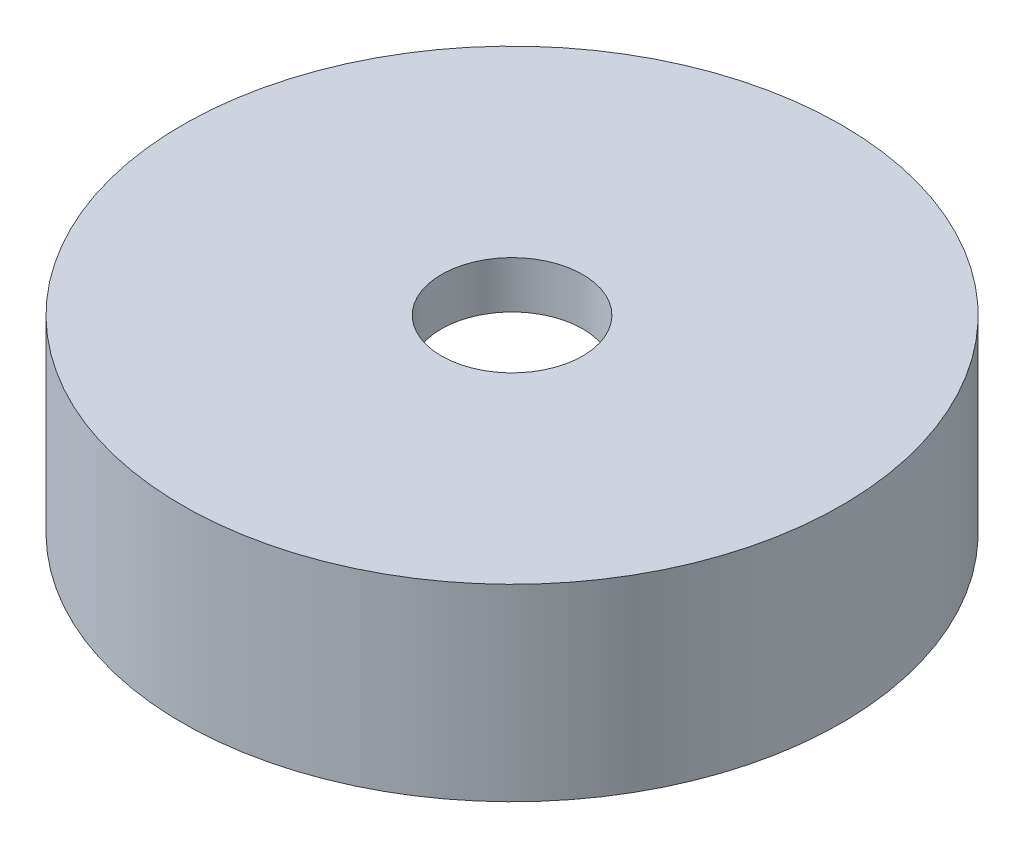
ISO-10303-21;
HEADER;
FILE_DESCRIPTION(('STEP AP214'),'2;1');
FILE_NAME('part.step','',(''),(''),'','','');
FILE_SCHEMA(('AUTOMOTIVE_DESIGN { 1 0 10303 214 1 1 1 1 }'));
ENDSEC;
DATA;
#1=APPLICATION_CONTEXT('core data for automotive mechanical design processes');
#2=APPLICATION_PROTOCOL_DEFINITION('international standard','automotive_design',2000,#1);
#3=PRODUCT_CONTEXT('',#1,'mechanical');
#4=PRODUCT('Part','Part','',(#3));
#5=PRODUCT_RELATED_PRODUCT_CATEGORY('part','',(#4));
#6=PRODUCT_DEFINITION_FORMATION('','',#4);
#7=PRODUCT_DEFINITION_CONTEXT('part definition',#1,'design');
#8=PRODUCT_DEFINITION('design','',#6,#7);
#9=PRODUCT_DEFINITION_SHAPE('','',#8);
#10=(LENGTH_UNIT() NAMED_UNIT(*) SI_UNIT(.MILLI.,.METRE.));
#11=(NAMED_UNIT(*) PLANE_ANGLE_UNIT() SI_UNIT($,.RADIAN.));
#12=(NAMED_UNIT(*) SI_UNIT($,.STERADIAN.) SOLID_ANGLE_UNIT());
#13=UNCERTAINTY_MEASURE_WITH_UNIT(LENGTH_MEASURE(1.E-05),#10,'distance_accuracy_value','');
#14=(GEOMETRIC_REPRESENTATION_CONTEXT(3) GLOBAL_UNCERTAINTY_ASSIGNED_CONTEXT((#13)) GLOBAL_UNIT_ASSIGNED_CONTEXT((#10,
#11,#12)) REPRESENTATION_CONTEXT('',''));
#15=CARTESIAN_POINT('',(0.,0.,0.));
#16=DIRECTION('',(0.,0.,1.));
#17=DIRECTION('',(1.,0.,0.));
#18=AXIS2_PLACEMENT_3D('',#15,#16,#17);
#19=CARTESIAN_POINT('',(0.,3.,0.));
#20=DIRECTION('',(0.,-1.,0.));
#21=DIRECTION('',(0.,0.,-1.));
#22=AXIS2_PLACEMENT_3D('',#19,#20,#21);
#23=PLANE('',#22);
#24=CARTESIAN_POINT('',(0.,3.,0.));
#25=DIRECTION('',(0.,-1.,0.));
#26=DIRECTION('',(0.,0.,-1.));
#27=AXIS2_PLACEMENT_3D('',#24,#25,#26);
#28=CIRCLE('',#27,1.49999999999999);
#29=CARTESIAN_POINT('',(0.,3.,-1.49999999999999));
#30=VERTEX_POINT('',#29);
#31=EDGE_CURVE('E60',#30,#30,#28,.T.);
#32=ORIENTED_EDGE('',*,*,#31,.F.);
#33=EDGE_LOOP('',(#32));
#34=FACE_BOUND('',#33,.T.);
#35=CARTESIAN_POINT('',(0.,3.,0.));
#36=DIRECTION('',(0.,-1.,0.));
#37=DIRECTION('',(0.,0.,-1.));
#38=AXIS2_PLACEMENT_3D('',#35,#36,#37);
#39=CIRCLE('',#38,6.);
#40=CARTESIAN_POINT('',(0.,3.,-6.));
#41=VERTEX_POINT('',#40);
#42=EDGE_CURVE('E10',#41,#41,#39,.T.);
#43=ORIENTED_EDGE('',*,*,#42,.T.);
#44=EDGE_LOOP('',(#43));
#45=FACE_BOUND('',#44,.T.);
#46=ADVANCED_FACE('F37',(#34,#45),#23,.T.);
#47=CARTESIAN_POINT('',(0.,0.,0.));
#48=DIRECTION('',(0.,-1.,0.));
#49=DIRECTION('',(0.,0.,-1.));
#50=AXIS2_PLACEMENT_3D('',#47,#48,#49);
#51=CYLINDRICAL_SURFACE('',#50,6.);
#52=CARTESIAN_POINT('',(0.,0.,0.));
#53=DIRECTION('',(0.,-1.,0.));
#54=DIRECTION('',(0.,0.,-1.));
#55=AXIS2_PLACEMENT_3D('',#52,#53,#54);
#56=CIRCLE('',#55,6.);
#57=CARTESIAN_POINT('',(0.,0.,-6.));
#58=VERTEX_POINT('',#57);
#59=EDGE_CURVE('E44',#58,#58,#56,.T.);
#60=ORIENTED_EDGE('',*,*,#59,.T.);
#61=EDGE_LOOP('',(#60));
#62=FACE_BOUND('',#61,.T.);
#63=ORIENTED_EDGE('',*,*,#42,.F.);
#64=EDGE_LOOP('',(#63));
#65=FACE_BOUND('',#64,.T.);
#66=ADVANCED_FACE('F86',(#62,#65),#51,.F.);
#67=CARTESIAN_POINT('',(6.,0.,0.));
#68=DIRECTION('',(0.,-1.,0.));
#69=DIRECTION('',(0.,0.,-1.));
#70=AXIS2_PLACEMENT_3D('',#67,#68,#69);
#71=PLANE('',#70);
#72=CARTESIAN_POINT('',(0.,0.,0.));
#73=DIRECTION('',(0.,-1.,0.));
#74=DIRECTION('',(0.,0.,-1.));
#75=AXIS2_PLACEMENT_3D('',#72,#73,#74);
#76=CIRCLE('',#75,7.);
#77=CARTESIAN_POINT('',(0.,0.,-7.));
#78=VERTEX_POINT('',#77);
#79=EDGE_CURVE('E49',#78,#78,#76,.T.);
#80=ORIENTED_EDGE('',*,*,#79,.T.);
#81=EDGE_LOOP('',(#80));
#82=FACE_BOUND('',#81,.T.);
#83=ORIENTED_EDGE('',*,*,#59,.F.);
#84=EDGE_LOOP('',(#83));
#85=FACE_BOUND('',#84,.T.);
#86=ADVANCED_FACE('F80',(#82,#85),#71,.T.);
#87=CARTESIAN_POINT('',(0.,0.,0.));
#88=DIRECTION('',(0.,-1.,0.));
#89=DIRECTION('',(0.,0.,-1.));
#90=AXIS2_PLACEMENT_3D('',#87,#88,#89);
#91=CYLINDRICAL_SURFACE('',#90,7.);
#92=CARTESIAN_POINT('',(0.,4.,0.));
#93=DIRECTION('',(0.,-1.,0.));
#94=DIRECTION('',(0.,0.,-1.));
#95=AXIS2_PLACEMENT_3D('',#92,#93,#94);
#96=CIRCLE('',#95,7.);
#97=CARTESIAN_POINT('',(0.,4.,-7.));
#98=VERTEX_POINT('',#97);
#99=EDGE_CURVE('E54',#98,#98,#96,.T.);
#100=ORIENTED_EDGE('',*,*,#99,.T.);
#101=EDGE_LOOP('',(#100));
#102=FACE_BOUND('',#101,.T.);
#103=ORIENTED_EDGE('',*,*,#79,.F.);
#104=EDGE_LOOP('',(#103));
#105=FACE_BOUND('',#104,.T.);
#106=ADVANCED_FACE('F74',(#102,#105),#91,.T.);
#107=CARTESIAN_POINT('',(0.,4.,0.));
#108=DIRECTION('',(0.,1.,0.));
#109=DIRECTION('',(0.,0.,1.));
#110=AXIS2_PLACEMENT_3D('',#107,#108,#109);
#111=PLANE('',#110);
#112=CARTESIAN_POINT('',(0.,4.,0.));
#113=DIRECTION('',(0.,1.,0.));
#114=DIRECTION('',(0.,0.,1.));
#115=AXIS2_PLACEMENT_3D('',#112,#113,#114);
#116=CIRCLE('',#115,1.49999999999999);
#117=CARTESIAN_POINT('',(0.,4.,1.49999999999999));
#118=VERTEX_POINT('',#117);
#119=EDGE_CURVE('E64',#118,#118,#116,.T.);
#120=ORIENTED_EDGE('',*,*,#119,.F.);
#121=EDGE_LOOP('',(#120));
#122=FACE_BOUND('',#121,.T.);
#123=ORIENTED_EDGE('',*,*,#99,.F.);
#124=EDGE_LOOP('',(#123));
#125=FACE_BOUND('',#124,.T.);
#126=ADVANCED_FACE('F71',(#122,#125),#111,.T.);
#127=CARTESIAN_POINT('',(0.,4.,0.));
#128=DIRECTION('',(0.,1.,0.));
#129=DIRECTION('',(0.,0.,1.));
#130=AXIS2_PLACEMENT_3D('',#127,#128,#129);
#131=CYLINDRICAL_SURFACE('',#130,1.49999999999999);
#132=ORIENTED_EDGE('',*,*,#31,.T.);
#133=EDGE_LOOP('',(#132));
#134=FACE_BOUND('',#133,.T.);
#135=ORIENTED_EDGE('',*,*,#119,.T.);
#136=EDGE_LOOP('',(#135));
#137=FACE_BOUND('',#136,.T.);
#138=ADVANCED_FACE('F69',(#134,#137),#131,.F.);
#139=CLOSED_SHELL('',(#46,#66,#86,#106,#126,#138));
#140=MANIFOLD_SOLID_BREP('B2',#139);
#141=ADVANCED_BREP_SHAPE_REPRESENTATION('',(#18,#140),#14);
#142=SHAPE_DEFINITION_REPRESENTATION(#9,#141);
ENDSEC;
END-ISO-10303-21;
